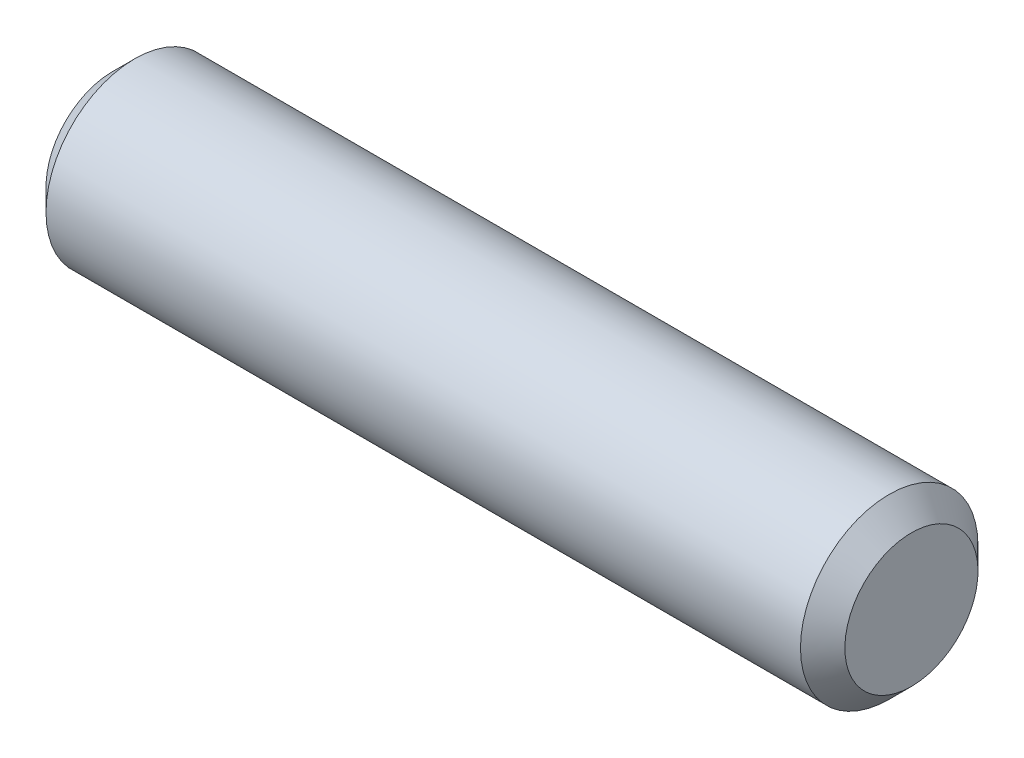
ISO-10303-21;
HEADER;
FILE_DESCRIPTION(('STEP AP214'),'2;1');
FILE_NAME('part.step','',(''),(''),'','','');
FILE_SCHEMA(('AUTOMOTIVE_DESIGN { 1 0 10303 214 1 1 1 1 }'));
ENDSEC;
DATA;
#1=APPLICATION_CONTEXT('core data for automotive mechanical design processes');
#2=APPLICATION_PROTOCOL_DEFINITION('international standard','automotive_design',2000,#1);
#3=PRODUCT_CONTEXT('',#1,'mechanical');
#4=PRODUCT('Part','Part','',(#3));
#5=PRODUCT_RELATED_PRODUCT_CATEGORY('part','',(#4));
#6=PRODUCT_DEFINITION_FORMATION('','',#4);
#7=PRODUCT_DEFINITION_CONTEXT('part definition',#1,'design');
#8=PRODUCT_DEFINITION('design','',#6,#7);
#9=PRODUCT_DEFINITION_SHAPE('','',#8);
#10=(LENGTH_UNIT() NAMED_UNIT(*) SI_UNIT(.MILLI.,.METRE.));
#11=(NAMED_UNIT(*) PLANE_ANGLE_UNIT() SI_UNIT($,.RADIAN.));
#12=(NAMED_UNIT(*) SI_UNIT($,.STERADIAN.) SOLID_ANGLE_UNIT());
#13=UNCERTAINTY_MEASURE_WITH_UNIT(LENGTH_MEASURE(1.E-05),#10,'distance_accuracy_value','');
#14=(GEOMETRIC_REPRESENTATION_CONTEXT(3) GLOBAL_UNCERTAINTY_ASSIGNED_CONTEXT((#13)) GLOBAL_UNIT_ASSIGNED_CONTEXT((#10,
#11,#12)) REPRESENTATION_CONTEXT('',''));
#15=CARTESIAN_POINT('',(0.,0.,0.));
#16=DIRECTION('',(0.,0.,1.));
#17=DIRECTION('',(1.,0.,0.));
#18=AXIS2_PLACEMENT_3D('',#15,#16,#17);
#19=CARTESIAN_POINT('',(14.2875,0.,0.));
#20=DIRECTION('',(1.,0.,0.));
#21=DIRECTION('',(0.,0.,-1.));
#22=AXIS2_PLACEMENT_3D('',#19,#20,#21);
#23=PLANE('',#22);
#24=CARTESIAN_POINT('',(14.2875000000231,0.,0.));
#25=DIRECTION('',(-1.,0.,0.));
#26=DIRECTION('',(0.,-1.,0.));
#27=AXIS2_PLACEMENT_3D('',#24,#25,#26);
#28=CIRCLE('',#27,2.3812499999849);
#29=CARTESIAN_POINT('',(14.2875000000231,-2.3812499999849,0.));
#30=VERTEX_POINT('',#29);
#31=EDGE_CURVE('E17',#30,#30,#28,.T.);
#32=ORIENTED_EDGE('',*,*,#31,.F.);
#33=EDGE_LOOP('',(#32));
#34=FACE_BOUND('',#33,.T.);
#35=ADVANCED_FACE('F14',(#34),#23,.T.);
#36=CARTESIAN_POINT('',(-14.2875,0.,0.));
#37=DIRECTION('',(1.,0.,0.));
#38=DIRECTION('',(0.,0.,-1.));
#39=AXIS2_PLACEMENT_3D('',#36,#37,#38);
#40=PLANE('',#39);
#41=CARTESIAN_POINT('',(-14.2874999999663,0.,0.));
#42=DIRECTION('',(1.,0.,0.));
#43=DIRECTION('',(0.,0.,-1.));
#44=AXIS2_PLACEMENT_3D('',#41,#42,#43);
#45=CIRCLE('',#44,2.38125000004175);
#46=CARTESIAN_POINT('',(-14.2874999999663,0.,-2.38125000004175));
#47=VERTEX_POINT('',#46);
#48=EDGE_CURVE('E26',#47,#47,#45,.T.);
#49=ORIENTED_EDGE('',*,*,#48,.F.);
#50=EDGE_LOOP('',(#49));
#51=FACE_BOUND('',#50,.T.);
#52=ADVANCED_FACE('F37',(#51),#40,.F.);
#53=CARTESIAN_POINT('',(13.493750000066,0.,0.));
#54=DIRECTION('',(-1.,0.,0.));
#55=DIRECTION('',(0.,-1.,0.));
#56=AXIS2_PLACEMENT_3D('',#53,#54,#55);
#57=CONICAL_SURFACE('',#56,3.17499999994197,0.785398163397448);
#58=CARTESIAN_POINT('',(13.49375,0.,0.));
#59=DIRECTION('',(-1.,0.,0.));
#60=DIRECTION('',(0.,0.,1.));
#61=AXIS2_PLACEMENT_3D('',#58,#59,#60);
#62=CIRCLE('',#61,3.175);
#63=CARTESIAN_POINT('',(13.49375,0.,3.175));
#64=VERTEX_POINT('',#63);
#65=EDGE_CURVE('E21',#64,#64,#62,.T.);
#66=ORIENTED_EDGE('',*,*,#65,.F.);
#67=EDGE_LOOP('',(#66));
#68=FACE_BOUND('',#67,.T.);
#69=ORIENTED_EDGE('',*,*,#31,.T.);
#70=EDGE_LOOP('',(#69));
#71=FACE_BOUND('',#70,.T.);
#72=ADVANCED_FACE('F34',(#68,#71),#57,.T.);
#73=CARTESIAN_POINT('',(-13.4937500000092,0.,0.));
#74=DIRECTION('',(1.,0.,0.));
#75=DIRECTION('',(0.,0.,-1.));
#76=AXIS2_PLACEMENT_3D('',#73,#74,#75);
#77=CONICAL_SURFACE('',#76,3.17499999994197,0.785398163361641);
#78=CARTESIAN_POINT('',(-13.49375,0.,0.));
#79=DIRECTION('',(-1.,0.,0.));
#80=DIRECTION('',(0.,0.,1.));
#81=AXIS2_PLACEMENT_3D('',#78,#79,#80);
#82=CIRCLE('',#81,3.175);
#83=CARTESIAN_POINT('',(-13.49375,0.,3.175));
#84=VERTEX_POINT('',#83);
#85=EDGE_CURVE('E10',#84,#84,#82,.F.);
#86=ORIENTED_EDGE('',*,*,#85,.F.);
#87=EDGE_LOOP('',(#86));
#88=FACE_BOUND('',#87,.T.);
#89=ORIENTED_EDGE('',*,*,#48,.T.);
#90=EDGE_LOOP('',(#89));
#91=FACE_BOUND('',#90,.T.);
#92=ADVANCED_FACE('F45',(#88,#91),#77,.T.);
#93=CARTESIAN_POINT('',(14.2875,0.,0.));
#94=DIRECTION('',(-1.,0.,0.));
#95=DIRECTION('',(0.,0.,1.));
#96=AXIS2_PLACEMENT_3D('',#93,#94,#95);
#97=CYLINDRICAL_SURFACE('',#96,3.175);
#98=ORIENTED_EDGE('',*,*,#85,.T.);
#99=EDGE_LOOP('',(#98));
#100=FACE_BOUND('',#99,.T.);
#101=ORIENTED_EDGE('',*,*,#65,.T.);
#102=EDGE_LOOP('',(#101));
#103=FACE_BOUND('',#102,.T.);
#104=ADVANCED_FACE('F43',(#100,#103),#97,.T.);
#105=CLOSED_SHELL('',(#35,#52,#72,#92,#104));
#106=MANIFOLD_SOLID_BREP('B1',#105);
#107=ADVANCED_BREP_SHAPE_REPRESENTATION('',(#18,#106),#14);
#108=SHAPE_DEFINITION_REPRESENTATION(#9,#107);
ENDSEC;
END-ISO-10303-21;
